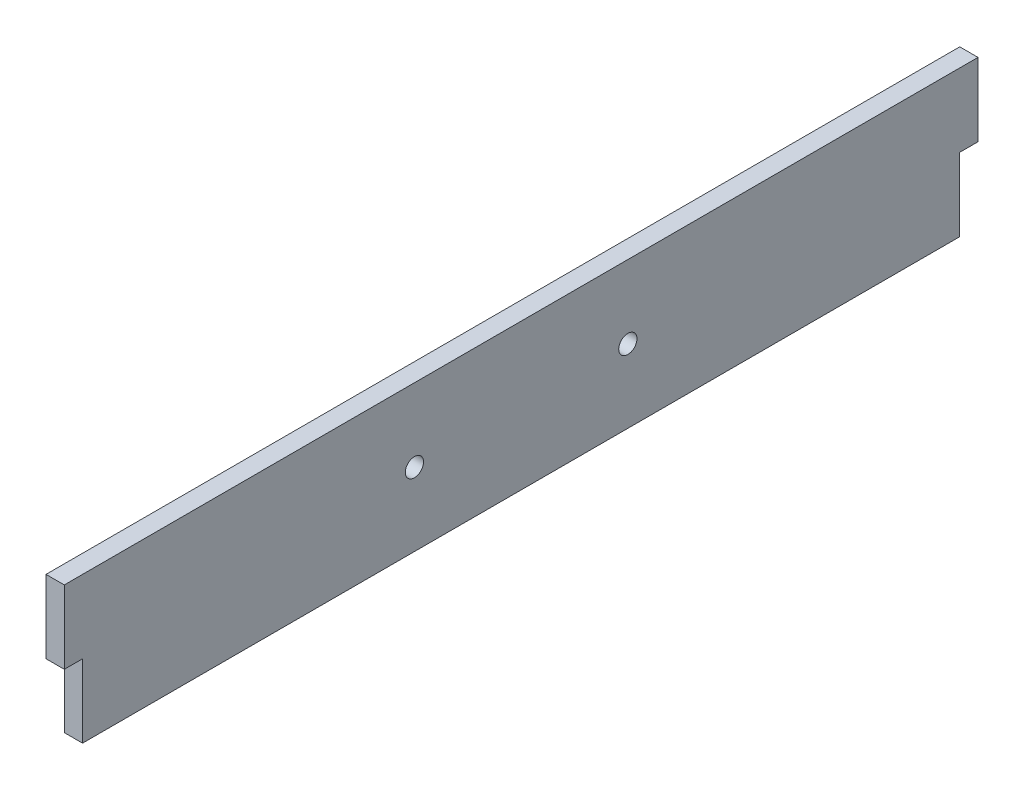
ISO-10303-21;
HEADER;
FILE_DESCRIPTION(('STEP AP214'),'2;1');
FILE_NAME('part.step','',(''),(''),'','','');
FILE_SCHEMA(('AUTOMOTIVE_DESIGN { 1 0 10303 214 1 1 1 1 }'));
ENDSEC;
DATA;
#1=APPLICATION_CONTEXT('core data for automotive mechanical design processes');
#2=APPLICATION_PROTOCOL_DEFINITION('international standard','automotive_design',2000,#1);
#3=PRODUCT_CONTEXT('',#1,'mechanical');
#4=PRODUCT('Part','Part','',(#3));
#5=PRODUCT_RELATED_PRODUCT_CATEGORY('part','',(#4));
#6=PRODUCT_DEFINITION_FORMATION('','',#4);
#7=PRODUCT_DEFINITION_CONTEXT('part definition',#1,'design');
#8=PRODUCT_DEFINITION('design','',#6,#7);
#9=PRODUCT_DEFINITION_SHAPE('','',#8);
#10=(LENGTH_UNIT() NAMED_UNIT(*) SI_UNIT(.MILLI.,.METRE.));
#11=(NAMED_UNIT(*) PLANE_ANGLE_UNIT() SI_UNIT($,.RADIAN.));
#12=(NAMED_UNIT(*) SI_UNIT($,.STERADIAN.) SOLID_ANGLE_UNIT());
#13=UNCERTAINTY_MEASURE_WITH_UNIT(LENGTH_MEASURE(1.E-05),#10,'distance_accuracy_value','');
#14=(GEOMETRIC_REPRESENTATION_CONTEXT(3) GLOBAL_UNCERTAINTY_ASSIGNED_CONTEXT((#13)) GLOBAL_UNIT_ASSIGNED_CONTEXT((#10,
#11,#12)) REPRESENTATION_CONTEXT('',''));
#15=CARTESIAN_POINT('',(0.,0.,0.));
#16=DIRECTION('',(0.,0.,1.));
#17=DIRECTION('',(1.,0.,0.));
#18=AXIS2_PLACEMENT_3D('',#15,#16,#17);
#19=CARTESIAN_POINT('',(3.175,0.,0.));
#20=DIRECTION('',(0.,0.,-1.));
#21=DIRECTION('',(-1.,0.,0.));
#22=AXIS2_PLACEMENT_3D('',#19,#20,#21);
#23=PLANE('',#22);
#24=DIRECTION('',(0.,-1.,0.));
#25=VECTOR('',#24,1.);
#26=CARTESIAN_POINT('',(0.,0.,0.));
#27=LINE('',#26,#25);
#28=CARTESIAN_POINT('',(0.,25.4,0.));
#29=VERTEX_POINT('',#28);
#30=CARTESIAN_POINT('',(0.,12.7,0.));
#31=VERTEX_POINT('',#30);
#32=EDGE_CURVE('E136',#29,#31,#27,.T.);
#33=ORIENTED_EDGE('',*,*,#32,.T.);
#34=DIRECTION('',(-1.,0.,0.));
#35=VECTOR('',#34,1.);
#36=CARTESIAN_POINT('',(3.175,12.7,0.));
#37=LINE('',#36,#35);
#38=CARTESIAN_POINT('',(3.175,12.7,0.));
#39=VERTEX_POINT('',#38);
#40=EDGE_CURVE('E59',#39,#31,#37,.T.);
#41=ORIENTED_EDGE('',*,*,#40,.F.);
#42=DIRECTION('',(0.,-1.,0.));
#43=VECTOR('',#42,1.);
#44=CARTESIAN_POINT('',(3.175,0.,0.));
#45=LINE('',#44,#43);
#46=CARTESIAN_POINT('',(3.175,25.4,0.));
#47=VERTEX_POINT('',#46);
#48=EDGE_CURVE('E126',#47,#39,#45,.T.);
#49=ORIENTED_EDGE('',*,*,#48,.F.);
#50=DIRECTION('',(-1.,0.,0.));
#51=VECTOR('',#50,1.);
#52=CARTESIAN_POINT('',(3.175,25.4,0.));
#53=LINE('',#52,#51);
#54=EDGE_CURVE('E44',#47,#29,#53,.T.);
#55=ORIENTED_EDGE('',*,*,#54,.T.);
#56=EDGE_LOOP('',(#33,#41,#49,#55));
#57=FACE_BOUND('',#56,.T.);
#58=ADVANCED_FACE('F37',(#57),#23,.F.);
#59=CARTESIAN_POINT('',(3.175,0.,0.));
#60=DIRECTION('',(0.,1.,0.));
#61=DIRECTION('',(0.,0.,1.));
#62=AXIS2_PLACEMENT_3D('',#59,#60,#61);
#63=PLANE('',#62);
#64=DIRECTION('',(0.,0.,-1.));
#65=VECTOR('',#64,1.);
#66=CARTESIAN_POINT('',(0.,0.,0.));
#67=LINE('',#66,#65);
#68=CARTESIAN_POINT('',(0.,3.19189119579733E-13,-3.17499999999996));
#69=VERTEX_POINT('',#68);
#70=CARTESIAN_POINT('',(0.,0.,-155.575));
#71=VERTEX_POINT('',#70);
#72=EDGE_CURVE('E118',#69,#71,#67,.T.);
#73=ORIENTED_EDGE('',*,*,#72,.T.);
#74=DIRECTION('',(-1.,0.,0.));
#75=VECTOR('',#74,1.);
#76=CARTESIAN_POINT('',(3.175,0.,-155.575));
#77=LINE('',#76,#75);
#78=CARTESIAN_POINT('',(3.175,0.,-155.575));
#79=VERTEX_POINT('',#78);
#80=EDGE_CURVE('E51',#79,#71,#77,.T.);
#81=ORIENTED_EDGE('',*,*,#80,.F.);
#82=DIRECTION('',(0.,0.,-1.));
#83=VECTOR('',#82,1.);
#84=CARTESIAN_POINT('',(3.175,0.,0.));
#85=LINE('',#84,#83);
#86=CARTESIAN_POINT('',(3.175,3.19189119579733E-13,-3.17499999999996));
#87=VERTEX_POINT('',#86);
#88=EDGE_CURVE('E116',#87,#79,#85,.T.);
#89=ORIENTED_EDGE('',*,*,#88,.F.);
#90=DIRECTION('',(-1.,0.,0.));
#91=VECTOR('',#90,1.);
#92=CARTESIAN_POINT('',(3.175,3.19189119579733E-13,-3.17499999999996));
#93=LINE('',#92,#91);
#94=EDGE_CURVE('E169',#87,#69,#93,.T.);
#95=ORIENTED_EDGE('',*,*,#94,.T.);
#96=EDGE_LOOP('',(#73,#81,#89,#95));
#97=FACE_BOUND('',#96,.T.);
#98=ADVANCED_FACE('F114',(#97),#63,.F.);
#99=CARTESIAN_POINT('',(3.175,0.,-158.75));
#100=DIRECTION('',(0.,0.,1.));
#101=DIRECTION('',(1.,0.,0.));
#102=AXIS2_PLACEMENT_3D('',#99,#100,#101);
#103=PLANE('',#102);
#104=DIRECTION('',(0.,1.,0.));
#105=VECTOR('',#104,1.);
#106=CARTESIAN_POINT('',(3.175,0.,-158.75));
#107=LINE('',#106,#105);
#108=CARTESIAN_POINT('',(3.175,12.7,-158.75));
#109=VERTEX_POINT('',#108);
#110=CARTESIAN_POINT('',(3.175,25.4,-158.75));
#111=VERTEX_POINT('',#110);
#112=EDGE_CURVE('E125',#109,#111,#107,.T.);
#113=ORIENTED_EDGE('',*,*,#112,.F.);
#114=DIRECTION('',(-1.,0.,0.));
#115=VECTOR('',#114,1.);
#116=CARTESIAN_POINT('',(3.175,12.7,-158.75));
#117=LINE('',#116,#115);
#118=CARTESIAN_POINT('',(0.,12.7,-158.75));
#119=VERTEX_POINT('',#118);
#120=EDGE_CURVE('E139',#109,#119,#117,.T.);
#121=ORIENTED_EDGE('',*,*,#120,.T.);
#122=DIRECTION('',(0.,1.,0.));
#123=VECTOR('',#122,1.);
#124=CARTESIAN_POINT('',(0.,0.,-158.75));
#125=LINE('',#124,#123);
#126=CARTESIAN_POINT('',(0.,25.4,-158.75));
#127=VERTEX_POINT('',#126);
#128=EDGE_CURVE('E141',#119,#127,#125,.T.);
#129=ORIENTED_EDGE('',*,*,#128,.T.);
#130=DIRECTION('',(-1.,0.,0.));
#131=VECTOR('',#130,1.);
#132=CARTESIAN_POINT('',(3.175,25.4,-158.75));
#133=LINE('',#132,#131);
#134=EDGE_CURVE('E11',#111,#127,#133,.T.);
#135=ORIENTED_EDGE('',*,*,#134,.F.);
#136=EDGE_LOOP('',(#113,#121,#129,#135));
#137=FACE_BOUND('',#136,.T.);
#138=ADVANCED_FACE('F199',(#137),#103,.F.);
#139=CARTESIAN_POINT('',(3.175,25.4,0.));
#140=DIRECTION('',(0.,-1.,0.));
#141=DIRECTION('',(0.,0.,-1.));
#142=AXIS2_PLACEMENT_3D('',#139,#140,#141);
#143=PLANE('',#142);
#144=DIRECTION('',(0.,0.,1.));
#145=VECTOR('',#144,1.);
#146=CARTESIAN_POINT('',(0.,25.4,0.));
#147=LINE('',#146,#145);
#148=EDGE_CURVE('E131',#127,#29,#147,.T.);
#149=ORIENTED_EDGE('',*,*,#148,.T.);
#150=ORIENTED_EDGE('',*,*,#54,.F.);
#151=DIRECTION('',(0.,0.,1.));
#152=VECTOR('',#151,1.);
#153=CARTESIAN_POINT('',(3.175,25.4,0.));
#154=LINE('',#153,#152);
#155=EDGE_CURVE('E128',#111,#47,#154,.T.);
#156=ORIENTED_EDGE('',*,*,#155,.F.);
#157=ORIENTED_EDGE('',*,*,#134,.T.);
#158=EDGE_LOOP('',(#149,#150,#156,#157));
#159=FACE_BOUND('',#158,.T.);
#160=ADVANCED_FACE('F200',(#159),#143,.F.);
#161=CARTESIAN_POINT('',(3.175,0.,0.));
#162=DIRECTION('',(-1.,0.,0.));
#163=DIRECTION('',(0.,0.,1.));
#164=AXIS2_PLACEMENT_3D('',#161,#162,#163);
#165=PLANE('',#164);
#166=CARTESIAN_POINT('',(3.175,12.7,-60.833));
#167=DIRECTION('',(-1.,0.,0.));
#168=DIRECTION('',(0.,0.,-1.));
#169=AXIS2_PLACEMENT_3D('',#166,#167,#168);
#170=CIRCLE('',#169,1.5875);
#171=CARTESIAN_POINT('',(3.175,12.7,-62.4205));
#172=VERTEX_POINT('',#171);
#173=EDGE_CURVE('E175',#172,#172,#170,.T.);
#174=ORIENTED_EDGE('',*,*,#173,.T.);
#175=EDGE_LOOP('',(#174));
#176=FACE_BOUND('',#175,.T.);
#177=CARTESIAN_POINT('',(3.175,12.7,-97.917));
#178=DIRECTION('',(-1.,0.,0.));
#179=DIRECTION('',(0.,0.,1.));
#180=AXIS2_PLACEMENT_3D('',#177,#178,#179);
#181=CIRCLE('',#180,1.5875);
#182=CARTESIAN_POINT('',(3.175,12.7,-96.3295));
#183=VERTEX_POINT('',#182);
#184=EDGE_CURVE('E159',#183,#183,#181,.T.);
#185=ORIENTED_EDGE('',*,*,#184,.T.);
#186=EDGE_LOOP('',(#185));
#187=FACE_BOUND('',#186,.T.);
#188=DIRECTION('',(0.,1.,0.));
#189=VECTOR('',#188,1.);
#190=CARTESIAN_POINT('',(3.175,0.,-155.575));
#191=LINE('',#190,#189);
#192=CARTESIAN_POINT('',(3.175,12.7,-155.575));
#193=VERTEX_POINT('',#192);
#194=EDGE_CURVE('E101',#79,#193,#191,.T.);
#195=ORIENTED_EDGE('',*,*,#194,.T.);
#196=DIRECTION('',(0.,0.,-1.));
#197=VECTOR('',#196,1.);
#198=CARTESIAN_POINT('',(3.175,12.7,-158.75));
#199=LINE('',#198,#197);
#200=EDGE_CURVE('E108',#193,#109,#199,.T.);
#201=ORIENTED_EDGE('',*,*,#200,.T.);
#202=ORIENTED_EDGE('',*,*,#112,.T.);
#203=ORIENTED_EDGE('',*,*,#155,.T.);
#204=ORIENTED_EDGE('',*,*,#48,.T.);
#205=DIRECTION('',(0.,0.,-1.));
#206=VECTOR('',#205,1.);
#207=CARTESIAN_POINT('',(3.175,12.7,0.));
#208=LINE('',#207,#206);
#209=CARTESIAN_POINT('',(3.175,12.7,-3.17500000000001));
#210=VERTEX_POINT('',#209);
#211=EDGE_CURVE('E161',#39,#210,#208,.T.);
#212=ORIENTED_EDGE('',*,*,#211,.T.);
#213=DIRECTION('',(0.,-1.,0.));
#214=VECTOR('',#213,1.);
#215=CARTESIAN_POINT('',(3.175,3.19189119579733E-13,-3.17499999999996));
#216=LINE('',#215,#214);
#217=EDGE_CURVE('E124',#210,#87,#216,.T.);
#218=ORIENTED_EDGE('',*,*,#217,.T.);
#219=ORIENTED_EDGE('',*,*,#88,.T.);
#220=EDGE_LOOP('',(#195,#201,#202,#203,#204,#212,#218,#219));
#221=FACE_BOUND('',#220,.T.);
#222=ADVANCED_FACE('F121',(#176,#187,#221),#165,.F.);
#223=CARTESIAN_POINT('',(0.,0.,0.));
#224=DIRECTION('',(-1.,0.,0.));
#225=DIRECTION('',(0.,0.,1.));
#226=AXIS2_PLACEMENT_3D('',#223,#224,#225);
#227=PLANE('',#226);
#228=DIRECTION('',(0.,0.,-1.));
#229=VECTOR('',#228,1.);
#230=CARTESIAN_POINT('',(0.,12.7,-158.75));
#231=LINE('',#230,#229);
#232=CARTESIAN_POINT('',(0.,12.7,-155.575));
#233=VERTEX_POINT('',#232);
#234=EDGE_CURVE('E109',#233,#119,#231,.T.);
#235=ORIENTED_EDGE('',*,*,#234,.F.);
#236=DIRECTION('',(0.,1.,0.));
#237=VECTOR('',#236,1.);
#238=CARTESIAN_POINT('',(0.,0.,-155.575));
#239=LINE('',#238,#237);
#240=EDGE_CURVE('E171',#71,#233,#239,.T.);
#241=ORIENTED_EDGE('',*,*,#240,.F.);
#242=ORIENTED_EDGE('',*,*,#72,.F.);
#243=DIRECTION('',(0.,-1.,0.));
#244=VECTOR('',#243,1.);
#245=CARTESIAN_POINT('',(0.,3.19189119579733E-13,-3.17499999999996));
#246=LINE('',#245,#244);
#247=CARTESIAN_POINT('',(0.,12.7,-3.17500000000001));
#248=VERTEX_POINT('',#247);
#249=EDGE_CURVE('E158',#248,#69,#246,.T.);
#250=ORIENTED_EDGE('',*,*,#249,.F.);
#251=DIRECTION('',(0.,0.,-1.));
#252=VECTOR('',#251,1.);
#253=CARTESIAN_POINT('',(0.,12.7,0.));
#254=LINE('',#253,#252);
#255=EDGE_CURVE('E157',#31,#248,#254,.T.);
#256=ORIENTED_EDGE('',*,*,#255,.F.);
#257=ORIENTED_EDGE('',*,*,#32,.F.);
#258=ORIENTED_EDGE('',*,*,#148,.F.);
#259=ORIENTED_EDGE('',*,*,#128,.F.);
#260=EDGE_LOOP('',(#235,#241,#242,#250,#256,#257,#258,#259));
#261=FACE_BOUND('',#260,.T.);
#262=CARTESIAN_POINT('',(0.,12.7,-60.833));
#263=DIRECTION('',(-1.,0.,0.));
#264=DIRECTION('',(0.,0.,-1.));
#265=AXIS2_PLACEMENT_3D('',#262,#263,#264);
#266=CIRCLE('',#265,1.5875);
#267=CARTESIAN_POINT('',(0.,12.7,-62.4205));
#268=VERTEX_POINT('',#267);
#269=EDGE_CURVE('E179',#268,#268,#266,.T.);
#270=ORIENTED_EDGE('',*,*,#269,.F.);
#271=EDGE_LOOP('',(#270));
#272=FACE_BOUND('',#271,.T.);
#273=CARTESIAN_POINT('',(0.,12.7,-97.917));
#274=DIRECTION('',(-1.,0.,0.));
#275=DIRECTION('',(0.,0.,1.));
#276=AXIS2_PLACEMENT_3D('',#273,#274,#275);
#277=CIRCLE('',#276,1.5875);
#278=CARTESIAN_POINT('',(0.,12.7,-96.3295));
#279=VERTEX_POINT('',#278);
#280=EDGE_CURVE('E164',#279,#279,#277,.T.);
#281=ORIENTED_EDGE('',*,*,#280,.F.);
#282=EDGE_LOOP('',(#281));
#283=FACE_BOUND('',#282,.T.);
#284=ADVANCED_FACE('F153',(#261,#272,#283),#227,.T.);
#285=CARTESIAN_POINT('',(3.175,3.19189119579733E-13,-3.17499999999996));
#286=DIRECTION('',(0.,0.,-1.));
#287=DIRECTION('',(0.,1.,0.));
#288=AXIS2_PLACEMENT_3D('',#285,#286,#287);
#289=PLANE('',#288);
#290=ORIENTED_EDGE('',*,*,#249,.T.);
#291=ORIENTED_EDGE('',*,*,#94,.F.);
#292=ORIENTED_EDGE('',*,*,#217,.F.);
#293=DIRECTION('',(-1.,0.,0.));
#294=VECTOR('',#293,1.);
#295=CARTESIAN_POINT('',(3.175,12.7,-3.17500000000001));
#296=LINE('',#295,#294);
#297=EDGE_CURVE('E172',#210,#248,#296,.T.);
#298=ORIENTED_EDGE('',*,*,#297,.T.);
#299=EDGE_LOOP('',(#290,#291,#292,#298));
#300=FACE_BOUND('',#299,.T.);
#301=ADVANCED_FACE('F188',(#300),#289,.F.);
#302=CARTESIAN_POINT('',(3.175,12.7,0.));
#303=DIRECTION('',(0.,1.,0.));
#304=DIRECTION('',(0.,0.,1.));
#305=AXIS2_PLACEMENT_3D('',#302,#303,#304);
#306=PLANE('',#305);
#307=ORIENTED_EDGE('',*,*,#255,.T.);
#308=ORIENTED_EDGE('',*,*,#297,.F.);
#309=ORIENTED_EDGE('',*,*,#211,.F.);
#310=ORIENTED_EDGE('',*,*,#40,.T.);
#311=EDGE_LOOP('',(#307,#308,#309,#310));
#312=FACE_BOUND('',#311,.T.);
#313=ADVANCED_FACE('F186',(#312),#306,.F.);
#314=CARTESIAN_POINT('',(3.175,12.7,-97.917));
#315=DIRECTION('',(-1.,0.,0.));
#316=DIRECTION('',(0.,0.,1.));
#317=AXIS2_PLACEMENT_3D('',#314,#315,#316);
#318=CYLINDRICAL_SURFACE('',#317,1.5875);
#319=ORIENTED_EDGE('',*,*,#184,.F.);
#320=EDGE_LOOP('',(#319));
#321=FACE_BOUND('',#320,.T.);
#322=ORIENTED_EDGE('',*,*,#280,.T.);
#323=EDGE_LOOP('',(#322));
#324=FACE_BOUND('',#323,.T.);
#325=ADVANCED_FACE('F251',(#321,#324),#318,.F.);
#326=CARTESIAN_POINT('',(3.175,12.7,-60.833));
#327=DIRECTION('',(-1.,0.,0.));
#328=DIRECTION('',(0.,0.,1.));
#329=AXIS2_PLACEMENT_3D('',#326,#327,#328);
#330=CYLINDRICAL_SURFACE('',#329,1.5875);
#331=ORIENTED_EDGE('',*,*,#173,.F.);
#332=EDGE_LOOP('',(#331));
#333=FACE_BOUND('',#332,.T.);
#334=ORIENTED_EDGE('',*,*,#269,.T.);
#335=EDGE_LOOP('',(#334));
#336=FACE_BOUND('',#335,.T.);
#337=ADVANCED_FACE('F260',(#333,#336),#330,.F.);
#338=CARTESIAN_POINT('',(3.175,12.7,-158.75));
#339=DIRECTION('',(0.,1.,0.));
#340=DIRECTION('',(0.,0.,1.));
#341=AXIS2_PLACEMENT_3D('',#338,#339,#340);
#342=PLANE('',#341);
#343=ORIENTED_EDGE('',*,*,#234,.T.);
#344=ORIENTED_EDGE('',*,*,#120,.F.);
#345=ORIENTED_EDGE('',*,*,#200,.F.);
#346=DIRECTION('',(-1.,0.,0.));
#347=VECTOR('',#346,1.);
#348=CARTESIAN_POINT('',(3.175,12.7,-155.575));
#349=LINE('',#348,#347);
#350=EDGE_CURVE('E103',#193,#233,#349,.T.);
#351=ORIENTED_EDGE('',*,*,#350,.T.);
#352=EDGE_LOOP('',(#343,#344,#345,#351));
#353=FACE_BOUND('',#352,.T.);
#354=ADVANCED_FACE('F195',(#353),#342,.F.);
#355=CARTESIAN_POINT('',(3.175,0.,-155.575));
#356=DIRECTION('',(0.,0.,1.));
#357=DIRECTION('',(1.,0.,0.));
#358=AXIS2_PLACEMENT_3D('',#355,#356,#357);
#359=PLANE('',#358);
#360=ORIENTED_EDGE('',*,*,#240,.T.);
#361=ORIENTED_EDGE('',*,*,#350,.F.);
#362=ORIENTED_EDGE('',*,*,#194,.F.);
#363=ORIENTED_EDGE('',*,*,#80,.T.);
#364=EDGE_LOOP('',(#360,#361,#362,#363));
#365=FACE_BOUND('',#364,.T.);
#366=ADVANCED_FACE('F102',(#365),#359,.F.);
#367=CLOSED_SHELL('',(#58,#98,#138,#160,#222,#284,#301,#313,#325,#337,#354,#366));
#368=MANIFOLD_SOLID_BREP('B2',#367);
#369=ADVANCED_BREP_SHAPE_REPRESENTATION('',(#18,#368),#14);
#370=SHAPE_DEFINITION_REPRESENTATION(#9,#369);
ENDSEC;
END-ISO-10303-21;
